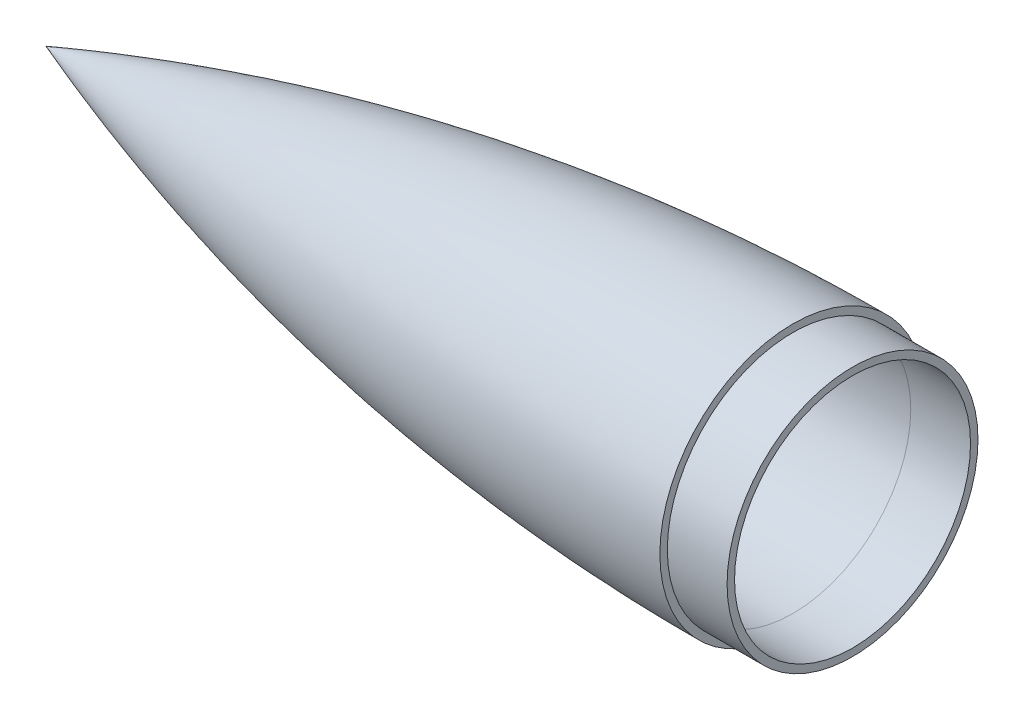
ISO-10303-21;
HEADER;
FILE_DESCRIPTION(('STEP AP214'),'2;1');
FILE_NAME('part.step','',(''),(''),'','','');
FILE_SCHEMA(('AUTOMOTIVE_DESIGN { 1 0 10303 214 1 1 1 1 }'));
ENDSEC;
DATA;
#1=APPLICATION_CONTEXT('core data for automotive mechanical design processes');
#2=APPLICATION_PROTOCOL_DEFINITION('international standard','automotive_design',2000,#1);
#3=PRODUCT_CONTEXT('',#1,'mechanical');
#4=PRODUCT('Part','Part','',(#3));
#5=PRODUCT_RELATED_PRODUCT_CATEGORY('part','',(#4));
#6=PRODUCT_DEFINITION_FORMATION('','',#4);
#7=PRODUCT_DEFINITION_CONTEXT('part definition',#1,'design');
#8=PRODUCT_DEFINITION('design','',#6,#7);
#9=PRODUCT_DEFINITION_SHAPE('','',#8);
#10=(LENGTH_UNIT() NAMED_UNIT(*) SI_UNIT(.MILLI.,.METRE.));
#11=(NAMED_UNIT(*) PLANE_ANGLE_UNIT() SI_UNIT($,.RADIAN.));
#12=(NAMED_UNIT(*) SI_UNIT($,.STERADIAN.) SOLID_ANGLE_UNIT());
#13=UNCERTAINTY_MEASURE_WITH_UNIT(LENGTH_MEASURE(1.E-05),#10,'distance_accuracy_value','');
#14=(GEOMETRIC_REPRESENTATION_CONTEXT(3) GLOBAL_UNCERTAINTY_ASSIGNED_CONTEXT((#13)) GLOBAL_UNIT_ASSIGNED_CONTEXT((#10,
#11,#12)) REPRESENTATION_CONTEXT('',''));
#15=CARTESIAN_POINT('',(0.,0.,0.));
#16=DIRECTION('',(0.,0.,1.));
#17=DIRECTION('',(1.,0.,0.));
#18=AXIS2_PLACEMENT_3D('',#15,#16,#17);
#19=CARTESIAN_POINT('',(250.000000001601,0.,-44.4999999912683));
#20=DIRECTION('',(1.,0.,0.));
#21=DIRECTION('',(0.,0.,-1.));
#22=AXIS2_PLACEMENT_3D('',#19,#20,#21);
#23=PLANE('',#22);
#24=CARTESIAN_POINT('',(250.000000001601,0.,0.));
#25=DIRECTION('',(1.,0.,0.));
#26=DIRECTION('',(0.,0.,-1.));
#27=AXIS2_PLACEMENT_3D('',#24,#25,#26);
#28=CIRCLE('',#27,44.4999999912683);
#29=CARTESIAN_POINT('',(250.000000001601,0.,-44.4999999912683));
#30=VERTEX_POINT('',#29);
#31=EDGE_CURVE('E11',#30,#30,#28,.T.);
#32=ORIENTED_EDGE('',*,*,#31,.T.);
#33=EDGE_LOOP('',(#32));
#34=FACE_BOUND('',#33,.T.);
#35=CARTESIAN_POINT('',(250.000000001601,0.,0.));
#36=DIRECTION('',(1.,0.,0.));
#37=DIRECTION('',(0.,0.,-1.));
#38=AXIS2_PLACEMENT_3D('',#35,#36,#37);
#39=CIRCLE('',#38,42.);
#40=CARTESIAN_POINT('',(250.000000001601,0.,-42.));
#41=VERTEX_POINT('',#40);
#42=EDGE_CURVE('E61',#41,#41,#39,.T.);
#43=ORIENTED_EDGE('',*,*,#42,.F.);
#44=EDGE_LOOP('',(#43));
#45=FACE_BOUND('',#44,.T.);
#46=ADVANCED_FACE('F35',(#34,#45),#23,.T.);
#47=CARTESIAN_POINT('',(250.00000000162,0.,-44.4999999912683));
#48=CARTESIAN_POINT('',(249.682882062091,0.,-44.4999999912794));
#49=CARTESIAN_POINT('',(249.04028860936,0.,-44.4994689638529));
#50=CARTESIAN_POINT('',(247.568859418525,0.,-44.4970793403871));
#51=CARTESIAN_POINT('',(246.275290560955,0.,-44.4907070250624));
#52=CARTESIAN_POINT('',(244.252268450471,0.,-44.4787589775998));
#53=CARTESIAN_POINT('',(242.432122976886,0.,-44.4615007957723));
#54=CARTESIAN_POINT('',(240.493833706151,0.,-44.4389326196877));
#55=CARTESIAN_POINT('',(237.472576922521,0.,-44.3943278839797));
#56=CARTESIAN_POINT('',(233.662897609346,0.,-44.3226431034155));
#57=CARTESIAN_POINT('',(229.495120467662,0.,-44.2175095352556));
#58=CARTESIAN_POINT('',(224.934095865007,0.,-44.0709701738882));
#59=CARTESIAN_POINT('',(221.141209661001,0.,-43.9276263903707));
#60=CARTESIAN_POINT('',(218.103602510905,0.,-43.8002167894877));
#61=CARTESIAN_POINT('',(215.06919469168,0.,-43.660074858663));
#62=CARTESIAN_POINT('',(212.033744301679,0.,-43.5072030620608));
#63=CARTESIAN_POINT('',(208.999953266476,0.,-43.3416040908964));
#64=CARTESIAN_POINT('',(205.96632580243,0.,-43.1632808551831));
#65=CARTESIAN_POINT('',(202.175598156396,0.,-42.924475410317));
#66=CARTESIAN_POINT('',(197.628210642018,0.,-42.6124733448877));
#67=CARTESIAN_POINT('',(190.810647438901,0.,-42.0967988018523));
#68=CARTESIAN_POINT('',(183.242282003827,0.,-41.4391315598729));
#69=CARTESIAN_POINT('',(175.681780324376,0.,-40.6968583871808));
#70=CARTESIAN_POINT('',(166.619827742546,0.,-39.7047323840147));
#71=CARTESIAN_POINT('',(159.07781203123,0.,-38.7935398243796));
#72=CARTESIAN_POINT('',(151.546451613811,0.,-37.7980515394943));
#73=CARTESIAN_POINT('',(144.026818506874,0.,-36.7184107799951));
#74=CARTESIAN_POINT('',(138.018565721987,0.,-35.8042671529773));
#75=CARTESIAN_POINT('',(130.518101583067,0.,-34.5986298864085));
#76=CARTESIAN_POINT('',(121.534145837689,0.,-33.0512674229458));
#77=CARTESIAN_POINT('',(111.078924907152,0.,-31.0996203540583));
#78=CARTESIAN_POINT('',(100.657911129957,0.,-28.9728507291801));
#79=CARTESIAN_POINT('',(91.7521513776309,0.,-27.0252485579695));
#80=CARTESIAN_POINT('',(82.8688606103887,0.,-24.9781935505384));
#81=CARTESIAN_POINT('',(74.0088995782969,0.,-22.831887621236));
#82=CARTESIAN_POINT('',(65.1796049093122,0.,-20.5618711275993));
#83=CARTESIAN_POINT('',(56.3831317897489,0.,-18.1687074587644));
#84=CARTESIAN_POINT('',(49.0755441876428,0.,-16.0925511919266));
#85=CARTESIAN_POINT('',(43.2437293067965,0.,-14.3826899061341));
#86=CARTESIAN_POINT('',(37.4262258578318,0.,-12.6238823602818));
#87=CARTESIAN_POINT('',(31.6241164846349,0.,-10.8164998691797));
#88=CARTESIAN_POINT('',(26.5599926404794,0.,-9.19224212210607));
#89=CARTESIAN_POINT('',(22.2303441153749,0.,-7.7701531863548));
#90=CARTESIAN_POINT('',(18.6271162057324,0.,-6.56422841539832));
#91=CARTESIAN_POINT('',(15.7521343263439,0.,-5.58870923625969));
#92=CARTESIAN_POINT('',(13.2330938025117,0.,-4.72199018955311));
#93=CARTESIAN_POINT('',(11.0886885551687,0.,-3.97603398912661));
#94=CARTESIAN_POINT('',(9.28344698790616,0.,-3.34204185049444));
#95=CARTESIAN_POINT('',(7.87675405628074,0.,-2.84524071937217));
#96=CARTESIAN_POINT('',(6.39633849925767,0.,-2.31794111940605));
#97=CARTESIAN_POINT('',(5.05191202210094,0.,-1.83724318603022));
#98=CARTESIAN_POINT('',(3.4751168714542,0.,-1.26772065553179));
#99=CARTESIAN_POINT('',(2.30163028088504,0.,-0.843079313764757));
#100=CARTESIAN_POINT('',(0.896935701745397,0.,-0.329191355773892));
#101=CARTESIAN_POINT('',(0.297640061409393,0.,-0.109426945181452));
#102=CARTESIAN_POINT('',(-4.54479088940091E-12,0.,1.67089479506799E-12));
#103=B_SPLINE_CURVE_WITH_KNOTS('',4,(#47,#48,#49,#50,#51,#52,#53,#54,#55,#56,#57,#58,#59,#60,
#61,#62,#63,#64,#65,#66,#67,#68,#69,#70,#71,#72,#73,#74,#75,#76,#77,#78,#79,#80,#81,#82,#83,#84,
#85,#86,#87,#88,#89,#90,#91,#92,#93,#94,#95,#96,#97,#98,#99,#100,#101,#102),.UNSPECIFIED.,.F.,
.F.,(5,1,1,1,1,1,1,1,1,1,1,1,1,1,1,1,1,1,1,1,1,1,1,1,1,1,1,1,1,1,1,1,1,1,1,1,1,1,1,1,1,1,1,1,1,
1,1,1,1,1,1,1,5),(0.0833231589572076,0.0882927316723407,0.0932623043874738,0.0982318771026069,
0.10320144981774,0.113140595248006,0.118110167963139,0.123079740678272,0.142958031076601,
0.16283632147493,0.172775467090834,0.182714612706737,0.192653758322641,0.202592903938544,
0.212532049471182,0.22247119500382,0.232410340536458,0.242349486069097,0.262227776282763,
0.28210606649643,0.321862647704563,0.341740940668691,0.36161923363282,0.401375810803239,
0.421254101743595,0.441132392683951,0.461010684596185,0.48088897650842,0.520645557279179,
0.560402133236106,0.600158721262447,0.620037014205775,0.639915307149103,0.679671883478864,
0.719428456847491,0.73930675163024,0.75918504641299,0.779063339434074,0.798941632455158,
0.818819916840166,0.838698201225174,0.848637349669851,0.858576498114527,0.868515646559204,
0.878454795003881,0.883424369570279,0.888393944136678,0.893363518703077,0.898333093269475,
0.903302667835874,0.908272242402272,0.913241816968671,0.91821139153507),.UNSPECIFIED.);
#104=CARTESIAN_POINT('',(250.000000001601,0.,0.));
#105=DIRECTION('',(1.,0.,0.));
#106=AXIS1_PLACEMENT('',#104,#105);
#107=SURFACE_OF_REVOLUTION('',#103,#106);
#108=CARTESIAN_POINT('',(0.,0.,0.));
#109=VERTEX_POINT('',#108);
#110=VERTEX_LOOP('',#109);
#111=FACE_BOUND('',#110,.T.);
#112=ORIENTED_EDGE('',*,*,#31,.F.);
#113=EDGE_LOOP('',(#112));
#114=FACE_BOUND('',#113,.T.);
#115=ADVANCED_FACE('F37',(#111,#114),#107,.F.);
#116=CARTESIAN_POINT('',(270.000000001601,0.,0.));
#117=DIRECTION('',(1.,0.,0.));
#118=DIRECTION('',(0.,0.,-1.));
#119=AXIS2_PLACEMENT_3D('',#116,#117,#118);
#120=PLANE('',#119);
#121=CARTESIAN_POINT('',(270.000000001601,0.,0.));
#122=DIRECTION('',(1.,0.,0.));
#123=DIRECTION('',(0.,0.,-1.));
#124=AXIS2_PLACEMENT_3D('',#121,#122,#123);
#125=CIRCLE('',#124,42.);
#126=CARTESIAN_POINT('',(270.000000001601,0.,-42.));
#127=VERTEX_POINT('',#126);
#128=EDGE_CURVE('E43',#127,#127,#125,.T.);
#129=ORIENTED_EDGE('',*,*,#128,.T.);
#130=EDGE_LOOP('',(#129));
#131=FACE_BOUND('',#130,.T.);
#132=CARTESIAN_POINT('',(270.000000001601,0.,0.));
#133=DIRECTION('',(1.,0.,0.));
#134=DIRECTION('',(0.,0.,-1.));
#135=AXIS2_PLACEMENT_3D('',#132,#133,#134);
#136=CIRCLE('',#135,39.5);
#137=CARTESIAN_POINT('',(270.000000001601,0.,-39.5));
#138=VERTEX_POINT('',#137);
#139=EDGE_CURVE('E58',#138,#138,#136,.T.);
#140=ORIENTED_EDGE('',*,*,#139,.F.);
#141=EDGE_LOOP('',(#140));
#142=FACE_BOUND('',#141,.T.);
#143=ADVANCED_FACE('F85',(#131,#142),#120,.T.);
#144=CARTESIAN_POINT('',(270.000000001601,0.,0.));
#145=DIRECTION('',(-1.,0.,0.));
#146=DIRECTION('',(0.,0.,1.));
#147=AXIS2_PLACEMENT_3D('',#144,#145,#146);
#148=CYLINDRICAL_SURFACE('',#147,42.);
#149=ORIENTED_EDGE('',*,*,#128,.F.);
#150=EDGE_LOOP('',(#149));
#151=FACE_BOUND('',#150,.T.);
#152=ORIENTED_EDGE('',*,*,#42,.T.);
#153=EDGE_LOOP('',(#152));
#154=FACE_BOUND('',#153,.T.);
#155=ADVANCED_FACE('F90',(#151,#154),#148,.T.);
#156=CARTESIAN_POINT('',(270.000000001601,0.,0.));
#157=DIRECTION('',(-1.,0.,0.));
#158=DIRECTION('',(0.,0.,1.));
#159=AXIS2_PLACEMENT_3D('',#156,#157,#158);
#160=CYLINDRICAL_SURFACE('',#159,39.5);
#161=ORIENTED_EDGE('',*,*,#139,.T.);
#162=EDGE_LOOP('',(#161));
#163=FACE_BOUND('',#162,.T.);
#164=CARTESIAN_POINT('',(250.000000001601,0.,0.));
#165=DIRECTION('',(1.,0.,0.));
#166=DIRECTION('',(0.,0.,-1.));
#167=AXIS2_PLACEMENT_3D('',#164,#165,#166);
#168=CIRCLE('',#167,39.5);
#169=CARTESIAN_POINT('',(250.000000001601,0.,-39.5));
#170=VERTEX_POINT('',#169);
#171=EDGE_CURVE('E56',#170,#170,#168,.T.);
#172=ORIENTED_EDGE('',*,*,#171,.F.);
#173=EDGE_LOOP('',(#172));
#174=FACE_BOUND('',#173,.T.);
#175=ADVANCED_FACE('F52',(#163,#174),#160,.F.);
#176=CARTESIAN_POINT('',(250.00000000162,0.,-44.4999999912683));
#177=CARTESIAN_POINT('',(249.682882062091,0.,-44.4999999912794));
#178=CARTESIAN_POINT('',(249.04028860936,0.,-44.4994689638529));
#179=CARTESIAN_POINT('',(247.568859418525,0.,-44.4970793403871));
#180=CARTESIAN_POINT('',(246.275290560955,0.,-44.4907070250624));
#181=CARTESIAN_POINT('',(244.252268450471,0.,-44.4787589775998));
#182=CARTESIAN_POINT('',(242.432122976886,0.,-44.4615007957723));
#183=CARTESIAN_POINT('',(240.493833706151,0.,-44.4389326196877));
#184=CARTESIAN_POINT('',(237.472576922521,0.,-44.3943278839797));
#185=CARTESIAN_POINT('',(233.662897609346,0.,-44.3226431034155));
#186=CARTESIAN_POINT('',(229.495120467662,0.,-44.2175095352556));
#187=CARTESIAN_POINT('',(224.934095865007,0.,-44.0709701738882));
#188=CARTESIAN_POINT('',(221.141209661001,0.,-43.9276263903707));
#189=CARTESIAN_POINT('',(218.103602510905,0.,-43.8002167894877));
#190=CARTESIAN_POINT('',(215.06919469168,0.,-43.660074858663));
#191=CARTESIAN_POINT('',(212.033744301679,0.,-43.5072030620608));
#192=CARTESIAN_POINT('',(208.999953266476,0.,-43.3416040908964));
#193=CARTESIAN_POINT('',(205.96632580243,0.,-43.1632808551831));
#194=CARTESIAN_POINT('',(202.175598156396,0.,-42.924475410317));
#195=CARTESIAN_POINT('',(197.628210642018,0.,-42.6124733448877));
#196=CARTESIAN_POINT('',(190.810647438901,0.,-42.0967988018523));
#197=CARTESIAN_POINT('',(183.242282003827,0.,-41.4391315598729));
#198=CARTESIAN_POINT('',(175.681780324376,0.,-40.6968583871808));
#199=CARTESIAN_POINT('',(166.619827742546,0.,-39.7047323840147));
#200=CARTESIAN_POINT('',(159.07781203123,0.,-38.7935398243796));
#201=CARTESIAN_POINT('',(151.546451613811,0.,-37.7980515394943));
#202=CARTESIAN_POINT('',(144.026818506874,0.,-36.7184107799951));
#203=CARTESIAN_POINT('',(138.018565721987,0.,-35.8042671529773));
#204=CARTESIAN_POINT('',(130.518101583067,0.,-34.5986298864085));
#205=CARTESIAN_POINT('',(121.534145837689,0.,-33.0512674229458));
#206=CARTESIAN_POINT('',(111.078924907152,0.,-31.0996203540583));
#207=CARTESIAN_POINT('',(100.657911129957,0.,-28.9728507291801));
#208=CARTESIAN_POINT('',(91.7521513776309,0.,-27.0252485579695));
#209=CARTESIAN_POINT('',(82.8688606103887,0.,-24.9781935505384));
#210=CARTESIAN_POINT('',(74.0088995782969,0.,-22.831887621236));
#211=CARTESIAN_POINT('',(65.1796049093122,0.,-20.5618711275993));
#212=CARTESIAN_POINT('',(56.3831317897489,0.,-18.1687074587644));
#213=CARTESIAN_POINT('',(49.0755441876428,0.,-16.0925511919266));
#214=CARTESIAN_POINT('',(43.2437293067965,0.,-14.3826899061341));
#215=CARTESIAN_POINT('',(37.4262258578318,0.,-12.6238823602818));
#216=CARTESIAN_POINT('',(31.6241164846349,0.,-10.8164998691797));
#217=CARTESIAN_POINT('',(26.5599926404794,0.,-9.19224212210607));
#218=CARTESIAN_POINT('',(22.2303441153749,0.,-7.7701531863548));
#219=CARTESIAN_POINT('',(18.6271162057324,0.,-6.56422841539832));
#220=CARTESIAN_POINT('',(16.2045224438151,0.,-5.74221047679672));
#221=CARTESIAN_POINT('',(14.4988376646163,0.,-5.15703983493498));
#222=CARTESIAN_POINT('',(13.5150154437695,0.,-4.81745152206691));
#223=CARTESIAN_POINT('',(13.2491417487694,0.,-4.72552696679303));
#224=B_SPLINE_CURVE_WITH_KNOTS('',4,(#176,#177,#178,#179,#180,#181,#182,#183,#184,#185,#186,
#187,#188,#189,#190,#191,#192,#193,#194,#195,#196,#197,#198,#199,#200,#201,#202,#203,#204,#205,
#206,#207,#208,#209,#210,#211,#212,#213,#214,#215,#216,#217,#218,#219,#220,#221,#222,#223),
.UNSPECIFIED.,.F.,.F.,(5,1,1,1,1,1,1,1,1,1,1,1,1,1,1,1,1,1,1,1,1,1,1,1,1,1,1,1,1,1,1,1,1,1,1,1,
1,1,1,1,1,1,1,1,5),(0.0833231589572076,0.0882927316723407,0.0932623043874738,0.0982318771026069,
0.10320144981774,0.113140595248006,0.118110167963139,0.123079740678272,0.142958031076601,
0.16283632147493,0.172775467090834,0.182714612706737,0.192653758322641,0.202592903938544,
0.212532049471182,0.22247119500382,0.232410340536458,0.242349486069097,0.262227776282763,
0.28210606649643,0.321862647704563,0.341740940668691,0.36161923363282,0.401375810803239,
0.421254101743595,0.441132392683951,0.461010684596185,0.48088897650842,0.520645557279179,
0.560402133236106,0.600158721262447,0.620037014205775,0.639915307149103,0.679671883478864,
0.719428456847491,0.73930675163024,0.75918504641299,0.779063339434074,0.798941632455158,
0.818819916840166,0.838698201225174,0.848637349669851,0.858576498114527,0.868515646559204,
0.872198960577389),.UNSPECIFIED.);
#225=CARTESIAN_POINT('',(250.000000001601,0.,0.));
#226=DIRECTION('',(1.,0.,0.));
#227=AXIS1_PLACEMENT('',#225,#226);
#228=SURFACE_OF_REVOLUTION('',#224,#227);
#229=OFFSET_SURFACE('',#228,5.,.F.);
#230=CARTESIAN_POINT('',(14.8829700402712,0.,0.));
#231=VERTEX_POINT('',#230);
#232=VERTEX_LOOP('',#231);
#233=FACE_BOUND('',#232,.T.);
#234=ORIENTED_EDGE('',*,*,#171,.T.);
#235=EDGE_LOOP('',(#234));
#236=FACE_BOUND('',#235,.T.);
#237=ADVANCED_FACE('F49',(#233,#236),#229,.T.);
#238=CLOSED_SHELL('',(#46,#115,#143,#155,#175,#237));
#239=MANIFOLD_SOLID_BREP('B2',#238);
#240=ADVANCED_BREP_SHAPE_REPRESENTATION('',(#18,#239),#14);
#241=SHAPE_DEFINITION_REPRESENTATION(#9,#240);
ENDSEC;
END-ISO-10303-21;
